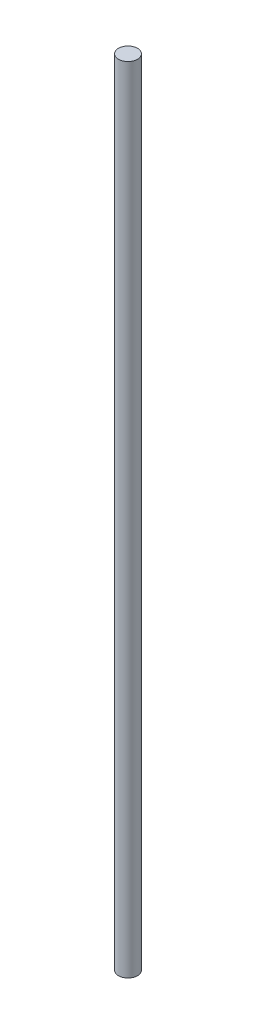
ISO-10303-21;
HEADER;
FILE_DESCRIPTION(('STEP AP214'),'2;1');
FILE_NAME('part.step','',(''),(''),'','','');
FILE_SCHEMA(('AUTOMOTIVE_DESIGN { 1 0 10303 214 1 1 1 1 }'));
ENDSEC;
DATA;
#1=APPLICATION_CONTEXT('core data for automotive mechanical design processes');
#2=APPLICATION_PROTOCOL_DEFINITION('international standard','automotive_design',2000,#1);
#3=PRODUCT_CONTEXT('',#1,'mechanical');
#4=PRODUCT('Part','Part','',(#3));
#5=PRODUCT_RELATED_PRODUCT_CATEGORY('part','',(#4));
#6=PRODUCT_DEFINITION_FORMATION('','',#4);
#7=PRODUCT_DEFINITION_CONTEXT('part definition',#1,'design');
#8=PRODUCT_DEFINITION('design','',#6,#7);
#9=PRODUCT_DEFINITION_SHAPE('','',#8);
#10=(LENGTH_UNIT() NAMED_UNIT(*) SI_UNIT(.MILLI.,.METRE.));
#11=(NAMED_UNIT(*) PLANE_ANGLE_UNIT() SI_UNIT($,.RADIAN.));
#12=(NAMED_UNIT(*) SI_UNIT($,.STERADIAN.) SOLID_ANGLE_UNIT());
#13=UNCERTAINTY_MEASURE_WITH_UNIT(LENGTH_MEASURE(1.E-05),#10,'distance_accuracy_value','');
#14=(GEOMETRIC_REPRESENTATION_CONTEXT(3) GLOBAL_UNCERTAINTY_ASSIGNED_CONTEXT((#13)) GLOBAL_UNIT_ASSIGNED_CONTEXT((#10,
#11,#12)) REPRESENTATION_CONTEXT('',''));
#15=CARTESIAN_POINT('',(0.,0.,0.));
#16=DIRECTION('',(0.,0.,1.));
#17=DIRECTION('',(1.,0.,0.));
#18=AXIS2_PLACEMENT_3D('',#15,#16,#17);
#19=CARTESIAN_POINT('',(0.,500.,0.));
#20=DIRECTION('',(0.,-1.,0.));
#21=DIRECTION('',(0.,0.,-1.));
#22=AXIS2_PLACEMENT_3D('',#19,#20,#21);
#23=CYLINDRICAL_SURFACE('',#22,6.);
#24=CARTESIAN_POINT('',(0.,500.,0.));
#25=DIRECTION('',(0.,1.,0.));
#26=DIRECTION('',(0.,0.,1.));
#27=AXIS2_PLACEMENT_3D('',#24,#25,#26);
#28=CIRCLE('',#27,6.);
#29=CARTESIAN_POINT('',(0.,500.,6.));
#30=VERTEX_POINT('',#29);
#31=EDGE_CURVE('E10',#30,#30,#28,.T.);
#32=ORIENTED_EDGE('',*,*,#31,.F.);
#33=EDGE_LOOP('',(#32));
#34=FACE_BOUND('',#33,.T.);
#35=CARTESIAN_POINT('',(0.,0.,0.));
#36=DIRECTION('',(0.,1.,0.));
#37=DIRECTION('',(0.,0.,1.));
#38=AXIS2_PLACEMENT_3D('',#35,#36,#37);
#39=CIRCLE('',#38,6.);
#40=CARTESIAN_POINT('',(0.,0.,6.));
#41=VERTEX_POINT('',#40);
#42=EDGE_CURVE('E40',#41,#41,#39,.T.);
#43=ORIENTED_EDGE('',*,*,#42,.T.);
#44=EDGE_LOOP('',(#43));
#45=FACE_BOUND('',#44,.T.);
#46=ADVANCED_FACE('F37',(#34,#45),#23,.T.);
#47=CARTESIAN_POINT('',(0.,500.,0.));
#48=DIRECTION('',(0.,1.,0.));
#49=DIRECTION('',(0.,0.,1.));
#50=AXIS2_PLACEMENT_3D('',#47,#48,#49);
#51=PLANE('',#50);
#52=ORIENTED_EDGE('',*,*,#31,.T.);
#53=EDGE_LOOP('',(#52));
#54=FACE_BOUND('',#53,.T.);
#55=ADVANCED_FACE('F52',(#54),#51,.T.);
#56=CARTESIAN_POINT('',(0.,0.,0.));
#57=DIRECTION('',(0.,1.,0.));
#58=DIRECTION('',(0.,0.,1.));
#59=AXIS2_PLACEMENT_3D('',#56,#57,#58);
#60=PLANE('',#59);
#61=ORIENTED_EDGE('',*,*,#42,.F.);
#62=EDGE_LOOP('',(#61));
#63=FACE_BOUND('',#62,.T.);
#64=ADVANCED_FACE('F50',(#63),#60,.F.);
#65=CLOSED_SHELL('',(#46,#55,#64));
#66=MANIFOLD_SOLID_BREP('B2',#65);
#67=ADVANCED_BREP_SHAPE_REPRESENTATION('',(#18,#66),#14);
#68=SHAPE_DEFINITION_REPRESENTATION(#9,#67);
ENDSEC;
END-ISO-10303-21;
